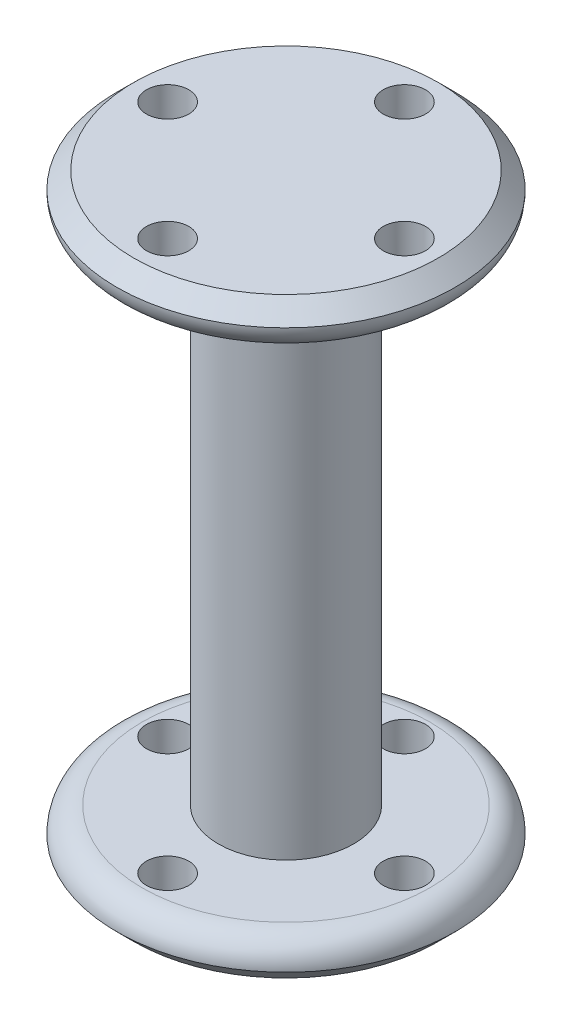
ISO-10303-21;
HEADER;
FILE_DESCRIPTION(('STEP AP214'),'2;1');
FILE_NAME('part.step','',(''),(''),'','','');
FILE_SCHEMA(('AUTOMOTIVE_DESIGN { 1 0 10303 214 1 1 1 1 }'));
ENDSEC;
DATA;
#1=APPLICATION_CONTEXT('core data for automotive mechanical design processes');
#2=APPLICATION_PROTOCOL_DEFINITION('international standard','automotive_design',2000,#1);
#3=PRODUCT_CONTEXT('',#1,'mechanical');
#4=PRODUCT('Part','Part','',(#3));
#5=PRODUCT_RELATED_PRODUCT_CATEGORY('part','',(#4));
#6=PRODUCT_DEFINITION_FORMATION('','',#4);
#7=PRODUCT_DEFINITION_CONTEXT('part definition',#1,'design');
#8=PRODUCT_DEFINITION('design','',#6,#7);
#9=PRODUCT_DEFINITION_SHAPE('','',#8);
#10=(LENGTH_UNIT() NAMED_UNIT(*) SI_UNIT(.MILLI.,.METRE.));
#11=(NAMED_UNIT(*) PLANE_ANGLE_UNIT() SI_UNIT($,.RADIAN.));
#12=(NAMED_UNIT(*) SI_UNIT($,.STERADIAN.) SOLID_ANGLE_UNIT());
#13=UNCERTAINTY_MEASURE_WITH_UNIT(LENGTH_MEASURE(1.E-05),#10,'distance_accuracy_value','');
#14=(GEOMETRIC_REPRESENTATION_CONTEXT(3) GLOBAL_UNCERTAINTY_ASSIGNED_CONTEXT((#13)) GLOBAL_UNIT_ASSIGNED_CONTEXT((#10,
#11,#12)) REPRESENTATION_CONTEXT('',''));
#15=CARTESIAN_POINT('',(0.,0.,0.));
#16=DIRECTION('',(0.,0.,1.));
#17=DIRECTION('',(1.,0.,0.));
#18=AXIS2_PLACEMENT_3D('',#15,#16,#17);
#19=CARTESIAN_POINT('',(0.,30.,0.));
#20=DIRECTION('',(0.,-1.,0.));
#21=DIRECTION('',(0.,0.,-1.));
#22=AXIS2_PLACEMENT_3D('',#19,#20,#21);
#23=CYLINDRICAL_SURFACE('',#22,8.);
#24=CARTESIAN_POINT('',(0.,30.,0.));
#25=DIRECTION('',(0.,1.,0.));
#26=DIRECTION('',(0.,0.,1.));
#27=AXIS2_PLACEMENT_3D('',#24,#25,#26);
#28=CIRCLE('',#27,8.);
#29=CARTESIAN_POINT('',(0.,30.,8.));
#30=VERTEX_POINT('',#29);
#31=EDGE_CURVE('E107',#30,#30,#28,.T.);
#32=ORIENTED_EDGE('',*,*,#31,.F.);
#33=EDGE_LOOP('',(#32));
#34=FACE_BOUND('',#33,.T.);
#35=CARTESIAN_POINT('',(0.,-30.,0.));
#36=DIRECTION('',(0.,1.,0.));
#37=DIRECTION('',(0.,0.,1.));
#38=AXIS2_PLACEMENT_3D('',#35,#36,#37);
#39=CIRCLE('',#38,8.);
#40=CARTESIAN_POINT('',(0.,-30.,8.));
#41=VERTEX_POINT('',#40);
#42=EDGE_CURVE('E64',#41,#41,#39,.T.);
#43=ORIENTED_EDGE('',*,*,#42,.T.);
#44=EDGE_LOOP('',(#43));
#45=FACE_BOUND('',#44,.T.);
#46=ADVANCED_FACE('F37',(#34,#45),#23,.T.);
#47=CARTESIAN_POINT('',(0.,35.,0.));
#48=DIRECTION('',(0.,1.,0.));
#49=DIRECTION('',(0.,0.,1.));
#50=AXIS2_PLACEMENT_3D('',#47,#48,#49);
#51=PLANE('',#50);
#52=CARTESIAN_POINT('',(-14.,35.,0.));
#53=DIRECTION('',(0.,1.,0.));
#54=DIRECTION('',(1.,0.,0.));
#55=AXIS2_PLACEMENT_3D('',#52,#53,#54);
#56=CIRCLE('',#55,2.5);
#57=CARTESIAN_POINT('',(-11.5,35.,0.));
#58=VERTEX_POINT('',#57);
#59=EDGE_CURVE('E88',#58,#58,#56,.T.);
#60=ORIENTED_EDGE('',*,*,#59,.F.);
#61=EDGE_LOOP('',(#60));
#62=FACE_BOUND('',#61,.T.);
#63=CARTESIAN_POINT('',(0.,35.,14.));
#64=DIRECTION('',(0.,1.,0.));
#65=DIRECTION('',(0.,0.,-1.));
#66=AXIS2_PLACEMENT_3D('',#63,#64,#65);
#67=CIRCLE('',#66,2.5);
#68=CARTESIAN_POINT('',(0.,35.,11.5));
#69=VERTEX_POINT('',#68);
#70=EDGE_CURVE('E93',#69,#69,#67,.T.);
#71=ORIENTED_EDGE('',*,*,#70,.F.);
#72=EDGE_LOOP('',(#71));
#73=FACE_BOUND('',#72,.T.);
#74=CARTESIAN_POINT('',(14.,35.,-1.47425311193403E-13));
#75=DIRECTION('',(0.,1.,0.));
#76=DIRECTION('',(-1.,0.,0.));
#77=AXIS2_PLACEMENT_3D('',#74,#75,#76);
#78=CIRCLE('',#77,2.5);
#79=CARTESIAN_POINT('',(11.5,35.,-1.21239201152079E-13));
#80=VERTEX_POINT('',#79);
#81=EDGE_CURVE('E97',#80,#80,#78,.T.);
#82=ORIENTED_EDGE('',*,*,#81,.F.);
#83=EDGE_LOOP('',(#82));
#84=FACE_BOUND('',#83,.T.);
#85=CARTESIAN_POINT('',(0.,35.,-14.));
#86=DIRECTION('',(0.,1.,0.));
#87=DIRECTION('',(0.,0.,1.));
#88=AXIS2_PLACEMENT_3D('',#85,#86,#87);
#89=CIRCLE('',#88,2.5);
#90=CARTESIAN_POINT('',(0.,35.,-11.5));
#91=VERTEX_POINT('',#90);
#92=EDGE_CURVE('E101',#91,#91,#89,.T.);
#93=ORIENTED_EDGE('',*,*,#92,.F.);
#94=EDGE_LOOP('',(#93));
#95=FACE_BOUND('',#94,.T.);
#96=CARTESIAN_POINT('',(0.,35.,0.));
#97=DIRECTION('',(0.,1.,0.));
#98=DIRECTION('',(0.,0.,1.));
#99=AXIS2_PLACEMENT_3D('',#96,#97,#98);
#100=CIRCLE('',#99,18.);
#101=CARTESIAN_POINT('',(0.,35.,18.));
#102=VERTEX_POINT('',#101);
#103=EDGE_CURVE('E111',#102,#102,#100,.T.);
#104=ORIENTED_EDGE('',*,*,#103,.T.);
#105=EDGE_LOOP('',(#104));
#106=FACE_BOUND('',#105,.T.);
#107=ADVANCED_FACE('F156',(#62,#73,#84,#95,#106),#51,.T.);
#108=CARTESIAN_POINT('',(0.,30.,0.));
#109=DIRECTION('',(0.,1.,0.));
#110=DIRECTION('',(0.,0.,1.));
#111=AXIS2_PLACEMENT_3D('',#108,#109,#110);
#112=PLANE('',#111);
#113=CARTESIAN_POINT('',(0.,30.,0.));
#114=DIRECTION('',(0.,1.,0.));
#115=DIRECTION('',(0.,0.,1.));
#116=AXIS2_PLACEMENT_3D('',#113,#114,#115);
#117=CIRCLE('',#116,17.);
#118=CARTESIAN_POINT('',(0.,30.,17.));
#119=VERTEX_POINT('',#118);
#120=EDGE_CURVE('E56',#119,#119,#117,.F.);
#121=ORIENTED_EDGE('',*,*,#120,.T.);
#122=EDGE_LOOP('',(#121));
#123=FACE_BOUND('',#122,.T.);
#124=CARTESIAN_POINT('',(-14.,30.,0.));
#125=DIRECTION('',(0.,1.,0.));
#126=DIRECTION('',(0.,0.,1.));
#127=AXIS2_PLACEMENT_3D('',#124,#125,#126);
#128=CIRCLE('',#127,2.5);
#129=CARTESIAN_POINT('',(-14.,30.,2.50000000000005));
#130=VERTEX_POINT('',#129);
#131=EDGE_CURVE('E106',#130,#130,#128,.T.);
#132=ORIENTED_EDGE('',*,*,#131,.T.);
#133=EDGE_LOOP('',(#132));
#134=FACE_BOUND('',#133,.T.);
#135=CARTESIAN_POINT('',(0.,30.,14.));
#136=DIRECTION('',(0.,1.,0.));
#137=DIRECTION('',(0.,0.,1.));
#138=AXIS2_PLACEMENT_3D('',#135,#136,#137);
#139=CIRCLE('',#138,2.5);
#140=CARTESIAN_POINT('',(0.,30.,16.5));
#141=VERTEX_POINT('',#140);
#142=EDGE_CURVE('E128',#141,#141,#139,.T.);
#143=ORIENTED_EDGE('',*,*,#142,.T.);
#144=EDGE_LOOP('',(#143));
#145=FACE_BOUND('',#144,.T.);
#146=CARTESIAN_POINT('',(14.,30.,-1.47425311193403E-13));
#147=DIRECTION('',(0.,1.,0.));
#148=DIRECTION('',(0.,0.,1.));
#149=AXIS2_PLACEMENT_3D('',#146,#147,#148);
#150=CIRCLE('',#149,2.5);
#151=CARTESIAN_POINT('',(14.,30.,2.49999999999985));
#152=VERTEX_POINT('',#151);
#153=EDGE_CURVE('E92',#152,#152,#150,.T.);
#154=ORIENTED_EDGE('',*,*,#153,.T.);
#155=EDGE_LOOP('',(#154));
#156=FACE_BOUND('',#155,.T.);
#157=CARTESIAN_POINT('',(0.,30.,-14.));
#158=DIRECTION('',(0.,1.,0.));
#159=DIRECTION('',(0.,0.,1.));
#160=AXIS2_PLACEMENT_3D('',#157,#158,#159);
#161=CIRCLE('',#160,2.5);
#162=CARTESIAN_POINT('',(0.,30.,-11.5));
#163=VERTEX_POINT('',#162);
#164=EDGE_CURVE('E105',#163,#163,#161,.T.);
#165=ORIENTED_EDGE('',*,*,#164,.T.);
#166=EDGE_LOOP('',(#165));
#167=FACE_BOUND('',#166,.T.);
#168=ORIENTED_EDGE('',*,*,#31,.T.);
#169=EDGE_LOOP('',(#168));
#170=FACE_BOUND('',#169,.T.);
#171=ADVANCED_FACE('F138',(#123,#134,#145,#156,#167,#170),#112,.F.);
#172=CARTESIAN_POINT('',(0.,35.,0.));
#173=DIRECTION('',(0.,-1.,0.));
#174=DIRECTION('',(0.,0.,-1.));
#175=AXIS2_PLACEMENT_3D('',#172,#173,#174);
#176=CONICAL_SURFACE('',#175,18.,0.785398163397447);
#177=CARTESIAN_POINT('',(0.,33.,0.));
#178=DIRECTION('',(0.,1.,0.));
#179=DIRECTION('',(0.,0.,1.));
#180=AXIS2_PLACEMENT_3D('',#177,#178,#179);
#181=CIRCLE('',#180,20.);
#182=CARTESIAN_POINT('',(0.,33.,20.));
#183=VERTEX_POINT('',#182);
#184=EDGE_CURVE('E118',#183,#183,#181,.F.);
#185=ORIENTED_EDGE('',*,*,#184,.F.);
#186=EDGE_LOOP('',(#185));
#187=FACE_BOUND('',#186,.T.);
#188=ORIENTED_EDGE('',*,*,#103,.F.);
#189=EDGE_LOOP('',(#188));
#190=FACE_BOUND('',#189,.T.);
#191=ADVANCED_FACE('F149',(#187,#190),#176,.T.);
#192=CARTESIAN_POINT('',(0.,-30.,-14.));
#193=DIRECTION('',(0.,1.,0.));
#194=DIRECTION('',(0.,0.,1.));
#195=AXIS2_PLACEMENT_3D('',#192,#193,#194);
#196=CYLINDRICAL_SURFACE('',#195,2.5);
#197=ORIENTED_EDGE('',*,*,#92,.T.);
#198=EDGE_LOOP('',(#197));
#199=FACE_BOUND('',#198,.T.);
#200=ORIENTED_EDGE('',*,*,#164,.F.);
#201=EDGE_LOOP('',(#200));
#202=FACE_BOUND('',#201,.T.);
#203=ADVANCED_FACE('F152',(#199,#202),#196,.F.);
#204=CARTESIAN_POINT('',(14.,-30.,-1.47425311193403E-13));
#205=DIRECTION('',(0.,1.,0.));
#206=DIRECTION('',(0.,0.,1.));
#207=AXIS2_PLACEMENT_3D('',#204,#205,#206);
#208=CYLINDRICAL_SURFACE('',#207,2.5);
#209=ORIENTED_EDGE('',*,*,#81,.T.);
#210=EDGE_LOOP('',(#209));
#211=FACE_BOUND('',#210,.T.);
#212=ORIENTED_EDGE('',*,*,#153,.F.);
#213=EDGE_LOOP('',(#212));
#214=FACE_BOUND('',#213,.T.);
#215=ADVANCED_FACE('F214',(#211,#214),#208,.F.);
#216=CARTESIAN_POINT('',(0.,-30.,14.));
#217=DIRECTION('',(0.,1.,0.));
#218=DIRECTION('',(0.,0.,1.));
#219=AXIS2_PLACEMENT_3D('',#216,#217,#218);
#220=CYLINDRICAL_SURFACE('',#219,2.5);
#221=ORIENTED_EDGE('',*,*,#70,.T.);
#222=EDGE_LOOP('',(#221));
#223=FACE_BOUND('',#222,.T.);
#224=ORIENTED_EDGE('',*,*,#142,.F.);
#225=EDGE_LOOP('',(#224));
#226=FACE_BOUND('',#225,.T.);
#227=ADVANCED_FACE('F211',(#223,#226),#220,.F.);
#228=CARTESIAN_POINT('',(-14.,-30.,0.));
#229=DIRECTION('',(0.,1.,0.));
#230=DIRECTION('',(0.,0.,1.));
#231=AXIS2_PLACEMENT_3D('',#228,#229,#230);
#232=CYLINDRICAL_SURFACE('',#231,2.5);
#233=ORIENTED_EDGE('',*,*,#59,.T.);
#234=EDGE_LOOP('',(#233));
#235=FACE_BOUND('',#234,.T.);
#236=ORIENTED_EDGE('',*,*,#131,.F.);
#237=EDGE_LOOP('',(#236));
#238=FACE_BOUND('',#237,.T.);
#239=ADVANCED_FACE('F145',(#235,#238),#232,.F.);
#240=CARTESIAN_POINT('',(0.,33.,0.));
#241=DIRECTION('',(0.,1.,0.));
#242=DIRECTION('',(0.,0.,1.));
#243=AXIS2_PLACEMENT_3D('',#240,#241,#242);
#244=TOROIDAL_SURFACE('',#243,17.,3.);
#245=ORIENTED_EDGE('',*,*,#120,.F.);
#246=EDGE_LOOP('',(#245));
#247=FACE_BOUND('',#246,.T.);
#248=ORIENTED_EDGE('',*,*,#184,.T.);
#249=EDGE_LOOP('',(#248));
#250=FACE_BOUND('',#249,.T.);
#251=ADVANCED_FACE('F141',(#247,#250),#244,.T.);
#252=CARTESIAN_POINT('',(0.,-35.,0.));
#253=DIRECTION('',(0.,-1.,0.));
#254=DIRECTION('',(0.,0.,1.));
#255=AXIS2_PLACEMENT_3D('',#252,#253,#254);
#256=PLANE('',#255);
#257=CARTESIAN_POINT('',(-14.,-35.,0.));
#258=DIRECTION('',(0.,1.,0.));
#259=DIRECTION('',(1.,0.,0.));
#260=AXIS2_PLACEMENT_3D('',#257,#258,#259);
#261=CIRCLE('',#260,2.5);
#262=CARTESIAN_POINT('',(-11.5,-35.,0.));
#263=VERTEX_POINT('',#262);
#264=EDGE_CURVE('E71',#263,#263,#261,.T.);
#265=ORIENTED_EDGE('',*,*,#264,.T.);
#266=EDGE_LOOP('',(#265));
#267=FACE_BOUND('',#266,.T.);
#268=CARTESIAN_POINT('',(0.,-35.,14.));
#269=DIRECTION('',(0.,1.,0.));
#270=DIRECTION('',(0.,0.,-1.));
#271=AXIS2_PLACEMENT_3D('',#268,#269,#270);
#272=CIRCLE('',#271,2.5);
#273=CARTESIAN_POINT('',(0.,-35.,11.5));
#274=VERTEX_POINT('',#273);
#275=EDGE_CURVE('E340',#274,#274,#272,.T.);
#276=ORIENTED_EDGE('',*,*,#275,.T.);
#277=EDGE_LOOP('',(#276));
#278=FACE_BOUND('',#277,.T.);
#279=CARTESIAN_POINT('',(14.,-35.,-1.47425311193403E-13));
#280=DIRECTION('',(0.,1.,0.));
#281=DIRECTION('',(-1.,0.,0.));
#282=AXIS2_PLACEMENT_3D('',#279,#280,#281);
#283=CIRCLE('',#282,2.5);
#284=CARTESIAN_POINT('',(11.5,-35.,-1.21239201152079E-13));
#285=VERTEX_POINT('',#284);
#286=EDGE_CURVE('E86',#285,#285,#283,.T.);
#287=ORIENTED_EDGE('',*,*,#286,.T.);
#288=EDGE_LOOP('',(#287));
#289=FACE_BOUND('',#288,.T.);
#290=CARTESIAN_POINT('',(0.,-35.,-14.));
#291=DIRECTION('',(0.,1.,0.));
#292=DIRECTION('',(0.,0.,1.));
#293=AXIS2_PLACEMENT_3D('',#290,#291,#292);
#294=CIRCLE('',#293,2.5);
#295=CARTESIAN_POINT('',(0.,-35.,-11.5));
#296=VERTEX_POINT('',#295);
#297=EDGE_CURVE('E65',#296,#296,#294,.T.);
#298=ORIENTED_EDGE('',*,*,#297,.T.);
#299=EDGE_LOOP('',(#298));
#300=FACE_BOUND('',#299,.T.);
#301=CARTESIAN_POINT('',(0.,-35.,0.));
#302=DIRECTION('',(0.,-1.,0.));
#303=DIRECTION('',(0.,0.,-1.));
#304=AXIS2_PLACEMENT_3D('',#301,#302,#303);
#305=CIRCLE('',#304,18.);
#306=CARTESIAN_POINT('',(0.,-35.,-18.));
#307=VERTEX_POINT('',#306);
#308=EDGE_CURVE('E45',#307,#307,#305,.T.);
#309=ORIENTED_EDGE('',*,*,#308,.T.);
#310=EDGE_LOOP('',(#309));
#311=FACE_BOUND('',#310,.T.);
#312=ADVANCED_FACE('F144',(#267,#278,#289,#300,#311),#256,.T.);
#313=CARTESIAN_POINT('',(0.,-30.,0.));
#314=DIRECTION('',(0.,-1.,0.));
#315=DIRECTION('',(0.,0.,1.));
#316=AXIS2_PLACEMENT_3D('',#313,#314,#315);
#317=PLANE('',#316);
#318=CARTESIAN_POINT('',(0.,-30.,0.));
#319=DIRECTION('',(0.,-1.,0.));
#320=DIRECTION('',(0.,0.,-1.));
#321=AXIS2_PLACEMENT_3D('',#318,#319,#320);
#322=CIRCLE('',#321,17.);
#323=CARTESIAN_POINT('',(0.,-30.,-17.));
#324=VERTEX_POINT('',#323);
#325=EDGE_CURVE('E10',#324,#324,#322,.F.);
#326=ORIENTED_EDGE('',*,*,#325,.T.);
#327=EDGE_LOOP('',(#326));
#328=FACE_BOUND('',#327,.T.);
#329=CARTESIAN_POINT('',(-14.,-30.,0.));
#330=DIRECTION('',(0.,-1.,0.));
#331=DIRECTION('',(0.,0.,-1.));
#332=AXIS2_PLACEMENT_3D('',#329,#330,#331);
#333=CIRCLE('',#332,2.5);
#334=CARTESIAN_POINT('',(-14.,-30.,-2.49999999999995));
#335=VERTEX_POINT('',#334);
#336=EDGE_CURVE('E74',#335,#335,#333,.F.);
#337=ORIENTED_EDGE('',*,*,#336,.F.);
#338=EDGE_LOOP('',(#337));
#339=FACE_BOUND('',#338,.T.);
#340=CARTESIAN_POINT('',(0.,-30.,14.));
#341=DIRECTION('',(0.,-1.,0.));
#342=DIRECTION('',(0.,0.,-1.));
#343=AXIS2_PLACEMENT_3D('',#340,#341,#342);
#344=CIRCLE('',#343,2.5);
#345=CARTESIAN_POINT('',(0.,-30.,11.5));
#346=VERTEX_POINT('',#345);
#347=EDGE_CURVE('E70',#346,#346,#344,.F.);
#348=ORIENTED_EDGE('',*,*,#347,.F.);
#349=EDGE_LOOP('',(#348));
#350=FACE_BOUND('',#349,.T.);
#351=CARTESIAN_POINT('',(14.,-30.,-1.47425311193403E-13));
#352=DIRECTION('',(0.,-1.,0.));
#353=DIRECTION('',(0.,0.,-1.));
#354=AXIS2_PLACEMENT_3D('',#351,#352,#353);
#355=CIRCLE('',#354,2.5);
#356=CARTESIAN_POINT('',(14.,-30.,-2.50000000000015));
#357=VERTEX_POINT('',#356);
#358=EDGE_CURVE('E66',#357,#357,#355,.F.);
#359=ORIENTED_EDGE('',*,*,#358,.F.);
#360=EDGE_LOOP('',(#359));
#361=FACE_BOUND('',#360,.T.);
#362=CARTESIAN_POINT('',(0.,-30.,-14.));
#363=DIRECTION('',(0.,-1.,0.));
#364=DIRECTION('',(0.,0.,-1.));
#365=AXIS2_PLACEMENT_3D('',#362,#363,#364);
#366=CIRCLE('',#365,2.5);
#367=CARTESIAN_POINT('',(0.,-30.,-16.5));
#368=VERTEX_POINT('',#367);
#369=EDGE_CURVE('E60',#368,#368,#366,.F.);
#370=ORIENTED_EDGE('',*,*,#369,.F.);
#371=EDGE_LOOP('',(#370));
#372=FACE_BOUND('',#371,.T.);
#373=ORIENTED_EDGE('',*,*,#42,.F.);
#374=EDGE_LOOP('',(#373));
#375=FACE_BOUND('',#374,.T.);
#376=ADVANCED_FACE('F174',(#328,#339,#350,#361,#372,#375),#317,.F.);
#377=CARTESIAN_POINT('',(0.,-33.,0.));
#378=DIRECTION('',(0.,1.,0.));
#379=DIRECTION('',(0.,0.,1.));
#380=AXIS2_PLACEMENT_3D('',#377,#378,#379);
#381=CONICAL_SURFACE('',#380,20.,0.785398163397443);
#382=ORIENTED_EDGE('',*,*,#308,.F.);
#383=EDGE_LOOP('',(#382));
#384=FACE_BOUND('',#383,.T.);
#385=CARTESIAN_POINT('',(0.,-33.,0.));
#386=DIRECTION('',(0.,-1.,0.));
#387=DIRECTION('',(0.,0.,-1.));
#388=AXIS2_PLACEMENT_3D('',#385,#386,#387);
#389=CIRCLE('',#388,20.);
#390=CARTESIAN_POINT('',(0.,-33.,-20.));
#391=VERTEX_POINT('',#390);
#392=EDGE_CURVE('E50',#391,#391,#389,.F.);
#393=ORIENTED_EDGE('',*,*,#392,.F.);
#394=EDGE_LOOP('',(#393));
#395=FACE_BOUND('',#394,.T.);
#396=ADVANCED_FACE('F171',(#384,#395),#381,.T.);
#397=CARTESIAN_POINT('',(0.,35.,-14.));
#398=DIRECTION('',(0.,-1.,0.));
#399=DIRECTION('',(0.,0.,-1.));
#400=AXIS2_PLACEMENT_3D('',#397,#398,#399);
#401=CYLINDRICAL_SURFACE('',#400,2.5);
#402=ORIENTED_EDGE('',*,*,#297,.F.);
#403=EDGE_LOOP('',(#402));
#404=FACE_BOUND('',#403,.T.);
#405=ORIENTED_EDGE('',*,*,#369,.T.);
#406=EDGE_LOOP('',(#405));
#407=FACE_BOUND('',#406,.T.);
#408=ADVANCED_FACE('F173',(#404,#407),#401,.F.);
#409=CARTESIAN_POINT('',(14.,35.,-1.47425311193403E-13));
#410=DIRECTION('',(0.,-1.,0.));
#411=DIRECTION('',(0.,0.,-1.));
#412=AXIS2_PLACEMENT_3D('',#409,#410,#411);
#413=CYLINDRICAL_SURFACE('',#412,2.5);
#414=ORIENTED_EDGE('',*,*,#286,.F.);
#415=EDGE_LOOP('',(#414));
#416=FACE_BOUND('',#415,.T.);
#417=ORIENTED_EDGE('',*,*,#358,.T.);
#418=EDGE_LOOP('',(#417));
#419=FACE_BOUND('',#418,.T.);
#420=ADVANCED_FACE('F180',(#416,#419),#413,.F.);
#421=CARTESIAN_POINT('',(0.,35.,14.));
#422=DIRECTION('',(0.,-1.,0.));
#423=DIRECTION('',(0.,0.,-1.));
#424=AXIS2_PLACEMENT_3D('',#421,#422,#423);
#425=CYLINDRICAL_SURFACE('',#424,2.5);
#426=ORIENTED_EDGE('',*,*,#275,.F.);
#427=EDGE_LOOP('',(#426));
#428=FACE_BOUND('',#427,.T.);
#429=ORIENTED_EDGE('',*,*,#347,.T.);
#430=EDGE_LOOP('',(#429));
#431=FACE_BOUND('',#430,.T.);
#432=ADVANCED_FACE('F193',(#428,#431),#425,.F.);
#433=CARTESIAN_POINT('',(-14.,35.,0.));
#434=DIRECTION('',(0.,-1.,0.));
#435=DIRECTION('',(0.,0.,-1.));
#436=AXIS2_PLACEMENT_3D('',#433,#434,#435);
#437=CYLINDRICAL_SURFACE('',#436,2.5);
#438=ORIENTED_EDGE('',*,*,#264,.F.);
#439=EDGE_LOOP('',(#438));
#440=FACE_BOUND('',#439,.T.);
#441=ORIENTED_EDGE('',*,*,#336,.T.);
#442=EDGE_LOOP('',(#441));
#443=FACE_BOUND('',#442,.T.);
#444=ADVANCED_FACE('F189',(#440,#443),#437,.F.);
#445=CARTESIAN_POINT('',(0.,-33.,0.));
#446=DIRECTION('',(0.,-1.,0.));
#447=DIRECTION('',(0.,0.,-1.));
#448=AXIS2_PLACEMENT_3D('',#445,#446,#447);
#449=TOROIDAL_SURFACE('',#448,17.,3.);
#450=ORIENTED_EDGE('',*,*,#392,.T.);
#451=EDGE_LOOP('',(#450));
#452=FACE_BOUND('',#451,.T.);
#453=ORIENTED_EDGE('',*,*,#325,.F.);
#454=EDGE_LOOP('',(#453));
#455=FACE_BOUND('',#454,.T.);
#456=ADVANCED_FACE('F39',(#452,#455),#449,.T.);
#457=CLOSED_SHELL('',(#46,#107,#171,#191,#203,#215,#227,#239,#251,#312,#376,#396,#408,#420,#432,
#444,#456));
#458=MANIFOLD_SOLID_BREP('B2',#457);
#459=ADVANCED_BREP_SHAPE_REPRESENTATION('',(#18,#458),#14);
#460=SHAPE_DEFINITION_REPRESENTATION(#9,#459);
ENDSEC;
END-ISO-10303-21;
